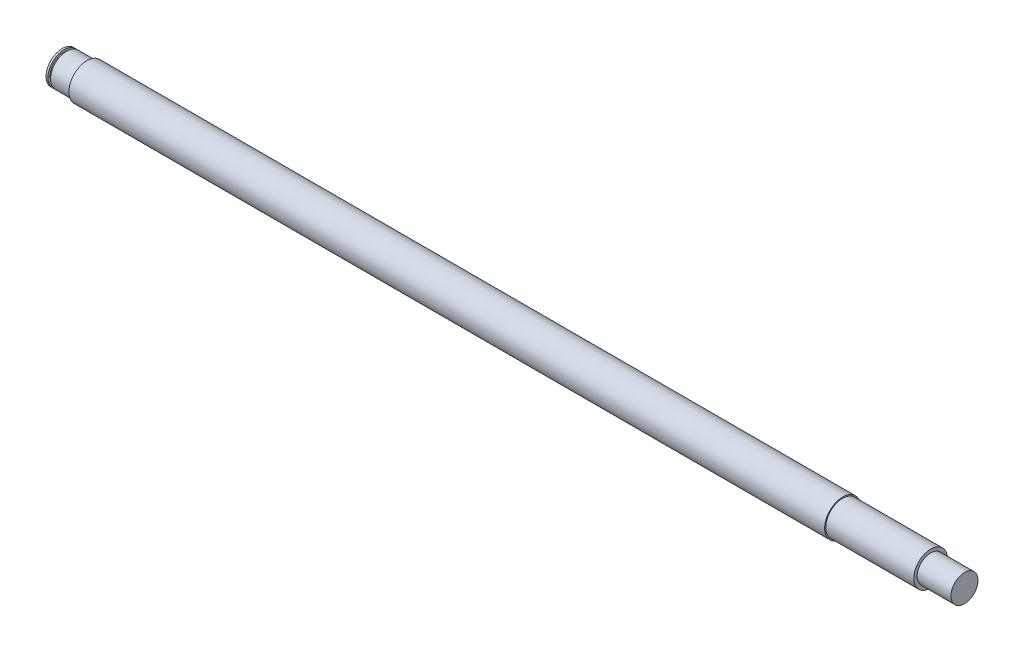
ISO-10303-21;
HEADER;
FILE_DESCRIPTION(('STEP AP214'),'2;1');
FILE_NAME('part.step','',(''),(''),'','','');
FILE_SCHEMA(('AUTOMOTIVE_DESIGN { 1 0 10303 214 1 1 1 1 }'));
ENDSEC;
DATA;
#1=APPLICATION_CONTEXT('core data for automotive mechanical design processes');
#2=APPLICATION_PROTOCOL_DEFINITION('international standard','automotive_design',2000,#1);
#3=PRODUCT_CONTEXT('',#1,'mechanical');
#4=PRODUCT('Part','Part','',(#3));
#5=PRODUCT_RELATED_PRODUCT_CATEGORY('part','',(#4));
#6=PRODUCT_DEFINITION_FORMATION('','',#4);
#7=PRODUCT_DEFINITION_CONTEXT('part definition',#1,'design');
#8=PRODUCT_DEFINITION('design','',#6,#7);
#9=PRODUCT_DEFINITION_SHAPE('','',#8);
#10=(LENGTH_UNIT() NAMED_UNIT(*) SI_UNIT(.MILLI.,.METRE.));
#11=(NAMED_UNIT(*) PLANE_ANGLE_UNIT() SI_UNIT($,.RADIAN.));
#12=(NAMED_UNIT(*) SI_UNIT($,.STERADIAN.) SOLID_ANGLE_UNIT());
#13=UNCERTAINTY_MEASURE_WITH_UNIT(LENGTH_MEASURE(1.E-05),#10,'distance_accuracy_value','');
#14=(GEOMETRIC_REPRESENTATION_CONTEXT(3) GLOBAL_UNCERTAINTY_ASSIGNED_CONTEXT((#13)) GLOBAL_UNIT_ASSIGNED_CONTEXT((#10,
#11,#12)) REPRESENTATION_CONTEXT('',''));
#15=CARTESIAN_POINT('',(0.,0.,0.));
#16=DIRECTION('',(0.,0.,1.));
#17=DIRECTION('',(1.,0.,0.));
#18=AXIS2_PLACEMENT_3D('',#15,#16,#17);
#19=CARTESIAN_POINT('',(0.,0.,0.));
#20=DIRECTION('',(1.,0.,0.));
#21=DIRECTION('',(0.,0.,-1.));
#22=AXIS2_PLACEMENT_3D('',#19,#20,#21);
#23=PLANE('',#22);
#24=CARTESIAN_POINT('',(0.,0.,0.));
#25=DIRECTION('',(-1.,0.,0.));
#26=DIRECTION('',(0.,0.,1.));
#27=AXIS2_PLACEMENT_3D('',#24,#25,#26);
#28=CIRCLE('',#27,7.15);
#29=CARTESIAN_POINT('',(0.,0.,7.15));
#30=VERTEX_POINT('',#29);
#31=EDGE_CURVE('E10',#30,#30,#28,.T.);
#32=ORIENTED_EDGE('',*,*,#31,.T.);
#33=EDGE_LOOP('',(#32));
#34=FACE_BOUND('',#33,.T.);
#35=ADVANCED_FACE('F32',(#34),#23,.F.);
#36=CARTESIAN_POINT('',(-271.922806094777,0.,0.));
#37=DIRECTION('',(-1.,0.,0.));
#38=DIRECTION('',(0.,0.,1.));
#39=AXIS2_PLACEMENT_3D('',#36,#37,#38);
#40=CYLINDRICAL_SURFACE('',#39,7.15);
#41=ORIENTED_EDGE('',*,*,#31,.F.);
#42=EDGE_LOOP('',(#41));
#43=FACE_BOUND('',#42,.T.);
#44=CARTESIAN_POINT('',(0.850000000000017,0.,0.));
#45=DIRECTION('',(-1.,0.,0.));
#46=DIRECTION('',(0.,0.,1.));
#47=AXIS2_PLACEMENT_3D('',#44,#45,#46);
#48=CIRCLE('',#47,7.15);
#49=CARTESIAN_POINT('',(0.850000000000017,0.,7.15));
#50=VERTEX_POINT('',#49);
#51=EDGE_CURVE('E38',#50,#50,#48,.T.);
#52=ORIENTED_EDGE('',*,*,#51,.T.);
#53=EDGE_LOOP('',(#52));
#54=FACE_BOUND('',#53,.T.);
#55=ADVANCED_FACE('F88',(#43,#54),#40,.T.);
#56=CARTESIAN_POINT('',(0.85,7.15,0.));
#57=DIRECTION('',(-1.,0.,0.));
#58=DIRECTION('',(0.,0.,1.));
#59=AXIS2_PLACEMENT_3D('',#56,#57,#58);
#60=PLANE('',#59);
#61=ORIENTED_EDGE('',*,*,#51,.F.);
#62=EDGE_LOOP('',(#61));
#63=FACE_BOUND('',#62,.T.);
#64=CARTESIAN_POINT('',(0.850000000000017,0.,0.));
#65=DIRECTION('',(-1.,0.,0.));
#66=DIRECTION('',(0.,0.,1.));
#67=AXIS2_PLACEMENT_3D('',#64,#65,#66);
#68=CIRCLE('',#67,6.15);
#69=CARTESIAN_POINT('',(0.850000000000017,0.,6.15));
#70=VERTEX_POINT('',#69);
#71=EDGE_CURVE('E42',#70,#70,#68,.T.);
#72=ORIENTED_EDGE('',*,*,#71,.T.);
#73=EDGE_LOOP('',(#72));
#74=FACE_BOUND('',#73,.T.);
#75=ADVANCED_FACE('F92',(#63,#74),#60,.F.);
#76=CARTESIAN_POINT('',(-271.922806094777,0.,0.));
#77=DIRECTION('',(-1.,0.,0.));
#78=DIRECTION('',(0.,0.,1.));
#79=AXIS2_PLACEMENT_3D('',#76,#77,#78);
#80=CYLINDRICAL_SURFACE('',#79,6.15);
#81=ORIENTED_EDGE('',*,*,#71,.F.);
#82=EDGE_LOOP('',(#81));
#83=FACE_BOUND('',#82,.T.);
#84=CARTESIAN_POINT('',(2.,0.,0.));
#85=DIRECTION('',(-1.,0.,0.));
#86=DIRECTION('',(0.,0.,1.));
#87=AXIS2_PLACEMENT_3D('',#84,#85,#86);
#88=CIRCLE('',#87,6.15);
#89=CARTESIAN_POINT('',(2.,0.,6.15));
#90=VERTEX_POINT('',#89);
#91=EDGE_CURVE('E46',#90,#90,#88,.T.);
#92=ORIENTED_EDGE('',*,*,#91,.T.);
#93=EDGE_LOOP('',(#92));
#94=FACE_BOUND('',#93,.T.);
#95=ADVANCED_FACE('F97',(#83,#94),#80,.T.);
#96=CARTESIAN_POINT('',(2.,6.15,0.));
#97=DIRECTION('',(1.,0.,0.));
#98=DIRECTION('',(0.,0.,-1.));
#99=AXIS2_PLACEMENT_3D('',#96,#97,#98);
#100=PLANE('',#99);
#101=ORIENTED_EDGE('',*,*,#91,.F.);
#102=EDGE_LOOP('',(#101));
#103=FACE_BOUND('',#102,.T.);
#104=CARTESIAN_POINT('',(2.,0.,0.));
#105=DIRECTION('',(-1.,0.,0.));
#106=DIRECTION('',(0.,0.,1.));
#107=AXIS2_PLACEMENT_3D('',#104,#105,#106);
#108=CIRCLE('',#107,7.15);
#109=CARTESIAN_POINT('',(2.,0.,7.15));
#110=VERTEX_POINT('',#109);
#111=EDGE_CURVE('E51',#110,#110,#108,.T.);
#112=ORIENTED_EDGE('',*,*,#111,.T.);
#113=EDGE_LOOP('',(#112));
#114=FACE_BOUND('',#113,.T.);
#115=ADVANCED_FACE('F103',(#103,#114),#100,.F.);
#116=CARTESIAN_POINT('',(-271.922806094777,0.,0.));
#117=DIRECTION('',(-1.,0.,0.));
#118=DIRECTION('',(0.,0.,1.));
#119=AXIS2_PLACEMENT_3D('',#116,#117,#118);
#120=CYLINDRICAL_SURFACE('',#119,7.15);
#121=ORIENTED_EDGE('',*,*,#111,.F.);
#122=EDGE_LOOP('',(#121));
#123=FACE_BOUND('',#122,.T.);
#124=CARTESIAN_POINT('',(11.,0.,0.));
#125=DIRECTION('',(-1.,0.,0.));
#126=DIRECTION('',(0.,0.,1.));
#127=AXIS2_PLACEMENT_3D('',#124,#125,#126);
#128=CIRCLE('',#127,7.15);
#129=CARTESIAN_POINT('',(11.,0.,7.15));
#130=VERTEX_POINT('',#129);
#131=EDGE_CURVE('E54',#130,#130,#128,.T.);
#132=ORIENTED_EDGE('',*,*,#131,.T.);
#133=EDGE_LOOP('',(#132));
#134=FACE_BOUND('',#133,.T.);
#135=ADVANCED_FACE('F107',(#123,#134),#120,.T.);
#136=CARTESIAN_POINT('',(11.,7.15,0.));
#137=DIRECTION('',(1.,0.,0.));
#138=DIRECTION('',(0.,0.,-1.));
#139=AXIS2_PLACEMENT_3D('',#136,#137,#138);
#140=PLANE('',#139);
#141=ORIENTED_EDGE('',*,*,#131,.F.);
#142=EDGE_LOOP('',(#141));
#143=FACE_BOUND('',#142,.T.);
#144=CARTESIAN_POINT('',(11.,0.,0.));
#145=DIRECTION('',(-1.,0.,0.));
#146=DIRECTION('',(0.,0.,1.));
#147=AXIS2_PLACEMENT_3D('',#144,#145,#146);
#148=CIRCLE('',#147,8.);
#149=CARTESIAN_POINT('',(11.,0.,8.));
#150=VERTEX_POINT('',#149);
#151=EDGE_CURVE('E57',#150,#150,#148,.T.);
#152=ORIENTED_EDGE('',*,*,#151,.T.);
#153=EDGE_LOOP('',(#152));
#154=FACE_BOUND('',#153,.T.);
#155=ADVANCED_FACE('F111',(#143,#154),#140,.F.);
#156=CARTESIAN_POINT('',(-271.922806094777,0.,0.));
#157=DIRECTION('',(-1.,0.,0.));
#158=DIRECTION('',(0.,0.,1.));
#159=AXIS2_PLACEMENT_3D('',#156,#157,#158);
#160=CYLINDRICAL_SURFACE('',#159,8.);
#161=ORIENTED_EDGE('',*,*,#151,.F.);
#162=EDGE_LOOP('',(#161));
#163=FACE_BOUND('',#162,.T.);
#164=CARTESIAN_POINT('',(346.,0.,0.));
#165=DIRECTION('',(-1.,0.,0.));
#166=DIRECTION('',(0.,0.,1.));
#167=AXIS2_PLACEMENT_3D('',#164,#165,#166);
#168=CIRCLE('',#167,8.);
#169=CARTESIAN_POINT('',(346.,0.,8.));
#170=VERTEX_POINT('',#169);
#171=EDGE_CURVE('E60',#170,#170,#168,.T.);
#172=ORIENTED_EDGE('',*,*,#171,.T.);
#173=EDGE_LOOP('',(#172));
#174=FACE_BOUND('',#173,.T.);
#175=ADVANCED_FACE('F115',(#163,#174),#160,.T.);
#176=CARTESIAN_POINT('',(346.,8.,0.));
#177=DIRECTION('',(-1.,0.,0.));
#178=DIRECTION('',(0.,0.,1.));
#179=AXIS2_PLACEMENT_3D('',#176,#177,#178);
#180=PLANE('',#179);
#181=ORIENTED_EDGE('',*,*,#171,.F.);
#182=EDGE_LOOP('',(#181));
#183=FACE_BOUND('',#182,.T.);
#184=CARTESIAN_POINT('',(346.,0.,0.));
#185=DIRECTION('',(-1.,0.,0.));
#186=DIRECTION('',(0.,0.,1.));
#187=AXIS2_PLACEMENT_3D('',#184,#185,#186);
#188=CIRCLE('',#187,7.5);
#189=CARTESIAN_POINT('',(346.,0.,7.5));
#190=VERTEX_POINT('',#189);
#191=EDGE_CURVE('E63',#190,#190,#188,.T.);
#192=ORIENTED_EDGE('',*,*,#191,.T.);
#193=EDGE_LOOP('',(#192));
#194=FACE_BOUND('',#193,.T.);
#195=ADVANCED_FACE('F119',(#183,#194),#180,.F.);
#196=CARTESIAN_POINT('',(-271.922806094777,0.,0.));
#197=DIRECTION('',(-1.,0.,0.));
#198=DIRECTION('',(0.,0.,1.));
#199=AXIS2_PLACEMENT_3D('',#196,#197,#198);
#200=CYLINDRICAL_SURFACE('',#199,7.5);
#201=ORIENTED_EDGE('',*,*,#191,.F.);
#202=EDGE_LOOP('',(#201));
#203=FACE_BOUND('',#202,.T.);
#204=CARTESIAN_POINT('',(385.,0.,0.));
#205=DIRECTION('',(-1.,0.,0.));
#206=DIRECTION('',(0.,0.,1.));
#207=AXIS2_PLACEMENT_3D('',#204,#205,#206);
#208=CIRCLE('',#207,7.5);
#209=CARTESIAN_POINT('',(385.,0.,7.5));
#210=VERTEX_POINT('',#209);
#211=EDGE_CURVE('E66',#210,#210,#208,.T.);
#212=ORIENTED_EDGE('',*,*,#211,.T.);
#213=EDGE_LOOP('',(#212));
#214=FACE_BOUND('',#213,.T.);
#215=ADVANCED_FACE('F123',(#203,#214),#200,.T.);
#216=CARTESIAN_POINT('',(385.,7.5,0.));
#217=DIRECTION('',(-1.,0.,0.));
#218=DIRECTION('',(0.,0.,1.));
#219=AXIS2_PLACEMENT_3D('',#216,#217,#218);
#220=PLANE('',#219);
#221=ORIENTED_EDGE('',*,*,#211,.F.);
#222=EDGE_LOOP('',(#221));
#223=FACE_BOUND('',#222,.T.);
#224=CARTESIAN_POINT('',(385.,0.,0.));
#225=DIRECTION('',(-1.,0.,0.));
#226=DIRECTION('',(0.,0.,1.));
#227=AXIS2_PLACEMENT_3D('',#224,#225,#226);
#228=CIRCLE('',#227,6.);
#229=CARTESIAN_POINT('',(385.,0.,6.));
#230=VERTEX_POINT('',#229);
#231=EDGE_CURVE('E69',#230,#230,#228,.T.);
#232=ORIENTED_EDGE('',*,*,#231,.T.);
#233=EDGE_LOOP('',(#232));
#234=FACE_BOUND('',#233,.T.);
#235=ADVANCED_FACE('F84',(#223,#234),#220,.F.);
#236=CARTESIAN_POINT('',(-271.922806094777,0.,0.));
#237=DIRECTION('',(-1.,0.,0.));
#238=DIRECTION('',(0.,0.,1.));
#239=AXIS2_PLACEMENT_3D('',#236,#237,#238);
#240=CYLINDRICAL_SURFACE('',#239,6.);
#241=ORIENTED_EDGE('',*,*,#231,.F.);
#242=EDGE_LOOP('',(#241));
#243=FACE_BOUND('',#242,.T.);
#244=CARTESIAN_POINT('',(400.,0.,0.));
#245=DIRECTION('',(-1.,0.,0.));
#246=DIRECTION('',(0.,0.,1.));
#247=AXIS2_PLACEMENT_3D('',#244,#245,#246);
#248=CIRCLE('',#247,6.);
#249=CARTESIAN_POINT('',(400.,0.,6.));
#250=VERTEX_POINT('',#249);
#251=EDGE_CURVE('E72',#250,#250,#248,.T.);
#252=ORIENTED_EDGE('',*,*,#251,.T.);
#253=EDGE_LOOP('',(#252));
#254=FACE_BOUND('',#253,.T.);
#255=ADVANCED_FACE('F76',(#243,#254),#240,.T.);
#256=CARTESIAN_POINT('',(400.,6.,0.));
#257=DIRECTION('',(-1.,0.,0.));
#258=DIRECTION('',(0.,0.,1.));
#259=AXIS2_PLACEMENT_3D('',#256,#257,#258);
#260=PLANE('',#259);
#261=ORIENTED_EDGE('',*,*,#251,.F.);
#262=EDGE_LOOP('',(#261));
#263=FACE_BOUND('',#262,.T.);
#264=ADVANCED_FACE('F78',(#263),#260,.F.);
#265=CLOSED_SHELL('',(#35,#55,#75,#95,#115,#135,#155,#175,#195,#215,#235,#255,#264));
#266=MANIFOLD_SOLID_BREP('B2',#265);
#267=ADVANCED_BREP_SHAPE_REPRESENTATION('',(#18,#266),#14);
#268=SHAPE_DEFINITION_REPRESENTATION(#9,#267);
ENDSEC;
END-ISO-10303-21;
